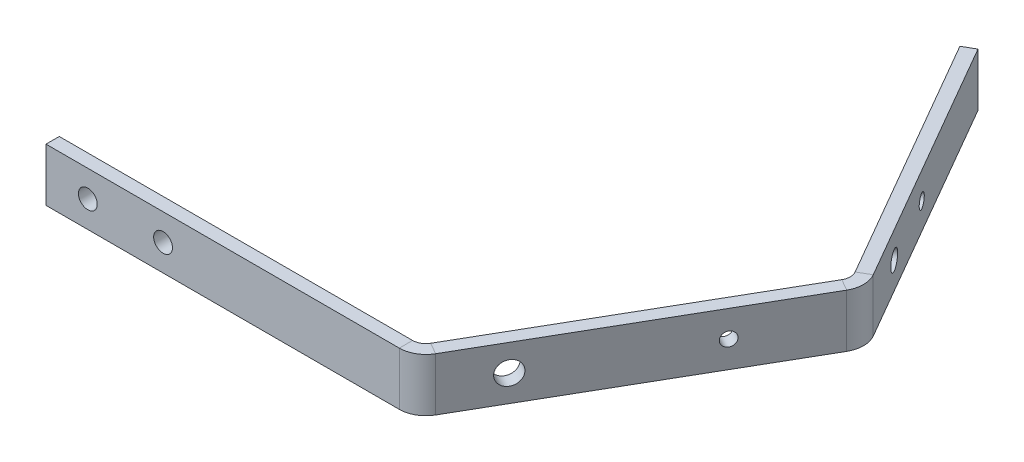
ISO-10303-21;
HEADER;
FILE_DESCRIPTION(('STEP AP214'),'2;1');
FILE_NAME('part.step','',(''),(''),'','','');
FILE_SCHEMA(('AUTOMOTIVE_DESIGN { 1 0 10303 214 1 1 1 1 }'));
ENDSEC;
DATA;
#1=APPLICATION_CONTEXT('core data for automotive mechanical design processes');
#2=APPLICATION_PROTOCOL_DEFINITION('international standard','automotive_design',2000,#1);
#3=PRODUCT_CONTEXT('',#1,'mechanical');
#4=PRODUCT('Part','Part','',(#3));
#5=PRODUCT_RELATED_PRODUCT_CATEGORY('part','',(#4));
#6=PRODUCT_DEFINITION_FORMATION('','',#4);
#7=PRODUCT_DEFINITION_CONTEXT('part definition',#1,'design');
#8=PRODUCT_DEFINITION('design','',#6,#7);
#9=PRODUCT_DEFINITION_SHAPE('','',#8);
#10=(LENGTH_UNIT() NAMED_UNIT(*) SI_UNIT(.MILLI.,.METRE.));
#11=(NAMED_UNIT(*) PLANE_ANGLE_UNIT() SI_UNIT($,.RADIAN.));
#12=(NAMED_UNIT(*) SI_UNIT($,.STERADIAN.) SOLID_ANGLE_UNIT());
#13=UNCERTAINTY_MEASURE_WITH_UNIT(LENGTH_MEASURE(1.E-05),#10,'distance_accuracy_value','');
#14=(GEOMETRIC_REPRESENTATION_CONTEXT(3) GLOBAL_UNCERTAINTY_ASSIGNED_CONTEXT((#13)) GLOBAL_UNIT_ASSIGNED_CONTEXT((#10,
#11,#12)) REPRESENTATION_CONTEXT('',''));
#15=CARTESIAN_POINT('',(0.,0.,0.));
#16=DIRECTION('',(0.,0.,1.));
#17=DIRECTION('',(1.,0.,0.));
#18=AXIS2_PLACEMENT_3D('',#15,#16,#17);
#19=CARTESIAN_POINT('',(-13.4757943029473,0.,-27.4034719360652));
#20=DIRECTION('',(-0.86602540378444,0.,-0.499999999999998));
#21=DIRECTION('',(-0.499999999999998,0.,0.86602540378444));
#22=AXIS2_PLACEMENT_3D('',#19,#20,#21);
#23=PLANE('',#22);
#24=CARTESIAN_POINT('',(-1.79699873723114,-7.51082345891387E-13,-47.6317392270958));
#25=DIRECTION('',(-0.86602540378444,0.,-0.499999999999998));
#26=DIRECTION('',(-0.499999999999998,0.,0.86602540378444));
#27=AXIS2_PLACEMENT_3D('',#24,#25,#26);
#28=CIRCLE('',#27,1.65000000164973);
#29=CARTESIAN_POINT('',(-2.621998738056,-7.51082345891387E-13,-46.2027973094228));
#30=VERTEX_POINT('',#29);
#31=EDGE_CURVE('E275',#30,#30,#28,.T.);
#32=ORIENTED_EDGE('',*,*,#31,.T.);
#33=EDGE_LOOP('',(#32));
#34=FACE_BOUND('',#33,.T.);
#35=CARTESIAN_POINT('',(-21.0087319455712,2.79637424327461E-12,-14.3560412087924));
#36=DIRECTION('',(0.86602540378444,0.,0.499999999999998));
#37=DIRECTION('',(0.499999999999998,0.,-0.86602540378444));
#38=AXIS2_PLACEMENT_3D('',#35,#36,#37);
#39=CIRCLE('',#38,2.75000000078553);
#40=CARTESIAN_POINT('',(-19.6337319451785,2.79637424327461E-12,-16.7376110698799));
#41=VERTEX_POINT('',#40);
#42=EDGE_CURVE('E259',#41,#41,#39,.T.);
#43=ORIENTED_EDGE('',*,*,#42,.F.);
#44=EDGE_LOOP('',(#43));
#45=FACE_BOUND('',#44,.T.);
#46=DIRECTION('',(0.499999999999998,0.,-0.86602540378444));
#47=VECTOR('',#46,1.);
#48=CARTESIAN_POINT('',(-72.225794302947,-6.35,74.3545130086064));
#49=LINE('',#48,#47);
#50=CARTESIAN_POINT('',(-27.4626657216148,-6.34999999999998,-3.17749999999999));
#51=VERTEX_POINT('',#50);
#52=CARTESIAN_POINT('',(8.5392056970526,-6.35,-65.5345704646941));
#53=VERTEX_POINT('',#52);
#54=EDGE_CURVE('E66',#51,#53,#49,.T.);
#55=ORIENTED_EDGE('',*,*,#54,.T.);
#56=DIRECTION('',(0.,1.,0.));
#57=VECTOR('',#56,1.);
#58=CARTESIAN_POINT('',(8.53920569705261,0.,-65.5345704646941));
#59=LINE('',#58,#57);
#60=CARTESIAN_POINT('',(8.5392056970526,6.35,-65.5345704646941));
#61=VERTEX_POINT('',#60);
#62=EDGE_CURVE('E58',#53,#61,#59,.T.);
#63=ORIENTED_EDGE('',*,*,#62,.T.);
#64=DIRECTION('',(-0.499999999999998,0.,0.86602540378444));
#65=VECTOR('',#64,1.);
#66=CARTESIAN_POINT('',(-72.225794302947,6.35,74.3545130086064));
#67=LINE('',#66,#65);
#68=CARTESIAN_POINT('',(-27.4626657216148,6.35,-3.17749999999999));
#69=VERTEX_POINT('',#68);
#70=EDGE_CURVE('E74',#61,#69,#67,.T.);
#71=ORIENTED_EDGE('',*,*,#70,.T.);
#72=DIRECTION('',(0.,1.,0.));
#73=VECTOR('',#72,1.);
#74=CARTESIAN_POINT('',(-27.4626657216148,0.,-3.17750000000003));
#75=LINE('',#74,#73);
#76=EDGE_CURVE('E236',#51,#69,#75,.T.);
#77=ORIENTED_EDGE('',*,*,#76,.F.);
#78=EDGE_LOOP('',(#55,#63,#71,#77));
#79=FACE_BOUND('',#78,.T.);
#80=ADVANCED_FACE('F49',(#34,#45,#79),#23,.F.);
#81=CARTESIAN_POINT('',(-74.9754249599627,-6.35,72.7670130086064));
#82=DIRECTION('',(0.,-1.,0.));
#83=DIRECTION('',(-0.86602540378444,0.,-0.499999999999998));
#84=AXIS2_PLACEMENT_3D('',#81,#82,#83);
#85=PLANE('',#84);
#86=DIRECTION('',(-0.86602540378444,0.,-0.499999999999998));
#87=VECTOR('',#86,1.);
#88=CARTESIAN_POINT('',(5.78957504003701,-6.35,-67.1220704646941));
#89=LINE('',#88,#87);
#90=CARTESIAN_POINT('',(5.789575040037,-6.35,-67.1220704646941));
#91=VERTEX_POINT('',#90);
#92=EDGE_CURVE('E12',#53,#91,#89,.T.);
#93=ORIENTED_EDGE('',*,*,#92,.F.);
#94=ORIENTED_EDGE('',*,*,#54,.F.);
#95=DIRECTION('',(-0.86602540378444,0.,-0.499999999999998));
#96=VECTOR('',#95,1.);
#97=CARTESIAN_POINT('',(-30.2122963786304,-6.35,-4.76500000000003));
#98=LINE('',#97,#96);
#99=CARTESIAN_POINT('',(-30.2122963786304,-6.34999999999999,-4.765));
#100=VERTEX_POINT('',#99);
#101=EDGE_CURVE('E232',#51,#100,#98,.T.);
#102=ORIENTED_EDGE('',*,*,#101,.T.);
#103=DIRECTION('',(0.499999999999998,0.,-0.86602540378444));
#104=VECTOR('',#103,1.);
#105=CARTESIAN_POINT('',(-74.9754249599627,-6.35,72.7670130086064));
#106=LINE('',#105,#104);
#107=EDGE_CURVE('E233',#100,#91,#106,.T.);
#108=ORIENTED_EDGE('',*,*,#107,.T.);
#109=EDGE_LOOP('',(#93,#94,#102,#108));
#110=FACE_BOUND('',#109,.T.);
#111=ADVANCED_FACE('F51',(#110),#85,.T.);
#112=CARTESIAN_POINT('',(-74.9754249599627,6.35,72.7670130086064));
#113=DIRECTION('',(0.,1.,0.));
#114=DIRECTION('',(0.86602540378444,0.,0.499999999999998));
#115=AXIS2_PLACEMENT_3D('',#112,#113,#114);
#116=PLANE('',#115);
#117=DIRECTION('',(0.86602540378444,0.,0.499999999999998));
#118=VECTOR('',#117,1.);
#119=CARTESIAN_POINT('',(5.78957504003701,6.35,-67.1220704646941));
#120=LINE('',#119,#118);
#121=CARTESIAN_POINT('',(5.78957504003699,6.35,-67.1220704646941));
#122=VERTEX_POINT('',#121);
#123=EDGE_CURVE('E244',#122,#61,#120,.T.);
#124=ORIENTED_EDGE('',*,*,#123,.F.);
#125=DIRECTION('',(-0.499999999999998,0.,0.86602540378444));
#126=VECTOR('',#125,1.);
#127=CARTESIAN_POINT('',(-74.9754249599627,6.35,72.7670130086064));
#128=LINE('',#127,#126);
#129=CARTESIAN_POINT('',(-30.2122963786304,6.35,-4.76500000000001));
#130=VERTEX_POINT('',#129);
#131=EDGE_CURVE('E249',#122,#130,#128,.T.);
#132=ORIENTED_EDGE('',*,*,#131,.T.);
#133=DIRECTION('',(0.86602540378444,0.,0.499999999999998));
#134=VECTOR('',#133,1.);
#135=CARTESIAN_POINT('',(-30.2122963786304,6.35,-4.76500000000003));
#136=LINE('',#135,#134);
#137=EDGE_CURVE('E239',#130,#69,#136,.T.);
#138=ORIENTED_EDGE('',*,*,#137,.T.);
#139=ORIENTED_EDGE('',*,*,#70,.F.);
#140=EDGE_LOOP('',(#124,#132,#138,#139));
#141=FACE_BOUND('',#140,.T.);
#142=ADVANCED_FACE('F317',(#141),#116,.T.);
#143=CARTESIAN_POINT('',(-16.2254249599629,0.,-28.9909719360652));
#144=DIRECTION('',(-0.86602540378444,0.,-0.499999999999998));
#145=DIRECTION('',(-0.499999999999998,0.,0.86602540378444));
#146=AXIS2_PLACEMENT_3D('',#143,#144,#145);
#147=PLANE('',#146);
#148=CARTESIAN_POINT('',(-4.54662939424674,-7.51082345891387E-13,-49.2192392270958));
#149=DIRECTION('',(-0.86602540378444,0.,-0.499999999999998));
#150=DIRECTION('',(-0.499999999999998,0.,0.86602540378444));
#151=AXIS2_PLACEMENT_3D('',#148,#149,#150);
#152=CIRCLE('',#151,1.65000000164973);
#153=CARTESIAN_POINT('',(-5.3716293950716,-7.51082345891387E-13,-47.7902973094228));
#154=VERTEX_POINT('',#153);
#155=EDGE_CURVE('E651',#154,#154,#152,.T.);
#156=ORIENTED_EDGE('',*,*,#155,.F.);
#157=EDGE_LOOP('',(#156));
#158=FACE_BOUND('',#157,.T.);
#159=CARTESIAN_POINT('',(-23.7583626025868,2.79637424327461E-12,-15.9435412087924));
#160=DIRECTION('',(-0.86602540378444,0.,-0.499999999999998));
#161=DIRECTION('',(-0.499999999999998,0.,0.86602540378444));
#162=AXIS2_PLACEMENT_3D('',#159,#160,#161);
#163=CIRCLE('',#162,2.75000000078553);
#164=CARTESIAN_POINT('',(-25.1333626029796,2.79637424327461E-12,-13.5619713477049));
#165=VERTEX_POINT('',#164);
#166=EDGE_CURVE('E256',#165,#165,#163,.T.);
#167=ORIENTED_EDGE('',*,*,#166,.F.);
#168=EDGE_LOOP('',(#167));
#169=FACE_BOUND('',#168,.T.);
#170=DIRECTION('',(0.,1.,0.));
#171=VECTOR('',#170,1.);
#172=CARTESIAN_POINT('',(5.78957504003702,0.,-67.1220704646941));
#173=LINE('',#172,#171);
#174=EDGE_CURVE('E241',#91,#122,#173,.T.);
#175=ORIENTED_EDGE('',*,*,#174,.F.);
#176=ORIENTED_EDGE('',*,*,#107,.F.);
#177=DIRECTION('',(0.,1.,0.));
#178=VECTOR('',#177,1.);
#179=CARTESIAN_POINT('',(-30.2122963786304,0.,-4.76500000000003));
#180=LINE('',#179,#178);
#181=EDGE_CURVE('E229',#100,#130,#180,.T.);
#182=ORIENTED_EDGE('',*,*,#181,.T.);
#183=ORIENTED_EDGE('',*,*,#131,.F.);
#184=EDGE_LOOP('',(#175,#176,#182,#183));
#185=FACE_BOUND('',#184,.T.);
#186=ADVANCED_FACE('F309',(#158,#169,#185),#147,.T.);
#187=CARTESIAN_POINT('',(-117.5,-6.35,-3.175));
#188=DIRECTION('',(-1.,0.,0.));
#189=DIRECTION('',(0.,0.,1.));
#190=AXIS2_PLACEMENT_3D('',#187,#188,#189);
#191=PLANE('',#190);
#192=DIRECTION('',(0.,-1.,0.));
#193=VECTOR('',#192,1.);
#194=CARTESIAN_POINT('',(-117.5,-6.35,0.));
#195=LINE('',#194,#193);
#196=CARTESIAN_POINT('',(-117.5,6.35,0.));
#197=VERTEX_POINT('',#196);
#198=CARTESIAN_POINT('',(-117.5,-6.35,0.));
#199=VERTEX_POINT('',#198);
#200=EDGE_CURVE('E204',#197,#199,#195,.T.);
#201=ORIENTED_EDGE('',*,*,#200,.F.);
#202=DIRECTION('',(0.,0.,1.));
#203=VECTOR('',#202,1.);
#204=CARTESIAN_POINT('',(-117.5,6.35,-3.175));
#205=LINE('',#204,#203);
#206=CARTESIAN_POINT('',(-117.5,6.35,-3.175));
#207=VERTEX_POINT('',#206);
#208=EDGE_CURVE('E199',#207,#197,#205,.T.);
#209=ORIENTED_EDGE('',*,*,#208,.F.);
#210=DIRECTION('',(0.,-1.,0.));
#211=VECTOR('',#210,1.);
#212=CARTESIAN_POINT('',(-117.5,-6.35,-3.175));
#213=LINE('',#212,#211);
#214=CARTESIAN_POINT('',(-117.5,-6.35,-3.175));
#215=VERTEX_POINT('',#214);
#216=EDGE_CURVE('E218',#207,#215,#213,.T.);
#217=ORIENTED_EDGE('',*,*,#216,.T.);
#218=DIRECTION('',(0.,0.,1.));
#219=VECTOR('',#218,1.);
#220=CARTESIAN_POINT('',(-117.5,-6.35,-3.175));
#221=LINE('',#220,#219);
#222=EDGE_CURVE('E216',#215,#199,#221,.T.);
#223=ORIENTED_EDGE('',*,*,#222,.T.);
#224=EDGE_LOOP('',(#201,#209,#217,#223));
#225=FACE_BOUND('',#224,.T.);
#226=ADVANCED_FACE('F349',(#225),#191,.T.);
#227=CARTESIAN_POINT('',(0.,0.,-3.175));
#228=DIRECTION('',(0.,0.,-1.));
#229=DIRECTION('',(-1.,0.,0.));
#230=AXIS2_PLACEMENT_3D('',#227,#228,#229);
#231=PLANE('',#230);
#232=CARTESIAN_POINT('',(-107.489373825115,-2.83280343627013E-12,-3.175));
#233=DIRECTION('',(0.,0.,-1.));
#234=DIRECTION('',(-1.,0.,0.));
#235=AXIS2_PLACEMENT_3D('',#232,#233,#234);
#236=CIRCLE('',#235,2.2500000000082);
#237=CARTESIAN_POINT('',(-109.739373825123,-2.83280343627013E-12,-3.175));
#238=VERTEX_POINT('',#237);
#239=EDGE_CURVE('E262',#238,#238,#236,.T.);
#240=ORIENTED_EDGE('',*,*,#239,.F.);
#241=EDGE_LOOP('',(#240));
#242=FACE_BOUND('',#241,.T.);
#243=CARTESIAN_POINT('',(-89.4893738254488,-2.82933398931817E-12,-3.175));
#244=DIRECTION('',(0.,0.,-1.));
#245=DIRECTION('',(-1.,0.,0.));
#246=AXIS2_PLACEMENT_3D('',#243,#244,#245);
#247=CIRCLE('',#246,2.25000000054032);
#248=CARTESIAN_POINT('',(-91.7393738259891,-2.82933398931817E-12,-3.175));
#249=VERTEX_POINT('',#248);
#250=EDGE_CURVE('E255',#249,#249,#247,.T.);
#251=ORIENTED_EDGE('',*,*,#250,.F.);
#252=EDGE_LOOP('',(#251));
#253=FACE_BOUND('',#252,.T.);
#254=DIRECTION('',(0.,1.,0.));
#255=VECTOR('',#254,1.);
#256=CARTESIAN_POINT('',(-32.9662571626649,0.,-3.175));
#257=LINE('',#256,#255);
#258=CARTESIAN_POINT('',(-32.9662571626649,-6.34999999999999,-3.175));
#259=VERTEX_POINT('',#258);
#260=CARTESIAN_POINT('',(-32.9662571626649,6.35,-3.175));
#261=VERTEX_POINT('',#260);
#262=EDGE_CURVE('E194',#259,#261,#257,.T.);
#263=ORIENTED_EDGE('',*,*,#262,.F.);
#264=DIRECTION('',(1.,0.,0.));
#265=VECTOR('',#264,1.);
#266=CARTESIAN_POINT('',(-117.5,-6.35,-3.175));
#267=LINE('',#266,#265);
#268=EDGE_CURVE('E214',#215,#259,#267,.T.);
#269=ORIENTED_EDGE('',*,*,#268,.F.);
#270=ORIENTED_EDGE('',*,*,#216,.F.);
#271=DIRECTION('',(-1.,0.,0.));
#272=VECTOR('',#271,1.);
#273=CARTESIAN_POINT('',(-117.5,6.35,-3.175));
#274=LINE('',#273,#272);
#275=EDGE_CURVE('E202',#261,#207,#274,.T.);
#276=ORIENTED_EDGE('',*,*,#275,.F.);
#277=EDGE_LOOP('',(#263,#269,#270,#276));
#278=FACE_BOUND('',#277,.T.);
#279=ADVANCED_FACE('F341',(#242,#253,#278),#231,.T.);
#280=CARTESIAN_POINT('',(-117.5,-6.35,-3.175));
#281=DIRECTION('',(0.,-1.,0.));
#282=DIRECTION('',(0.,0.,-1.));
#283=AXIS2_PLACEMENT_3D('',#280,#281,#282);
#284=PLANE('',#283);
#285=DIRECTION('',(0.,0.,-1.));
#286=VECTOR('',#285,1.);
#287=CARTESIAN_POINT('',(-32.9662571626649,-6.35,-3.175));
#288=LINE('',#287,#286);
#289=CARTESIAN_POINT('',(-32.9662571626649,-6.35,0.));
#290=VERTEX_POINT('',#289);
#291=EDGE_CURVE('E221',#290,#259,#288,.T.);
#292=ORIENTED_EDGE('',*,*,#291,.F.);
#293=DIRECTION('',(1.,0.,0.));
#294=VECTOR('',#293,1.);
#295=CARTESIAN_POINT('',(-117.5,-6.35,0.));
#296=LINE('',#295,#294);
#297=EDGE_CURVE('E212',#199,#290,#296,.T.);
#298=ORIENTED_EDGE('',*,*,#297,.F.);
#299=ORIENTED_EDGE('',*,*,#222,.F.);
#300=ORIENTED_EDGE('',*,*,#268,.T.);
#301=EDGE_LOOP('',(#292,#298,#299,#300));
#302=FACE_BOUND('',#301,.T.);
#303=ADVANCED_FACE('F337',(#302),#284,.T.);
#304=CARTESIAN_POINT('',(0.,0.,0.));
#305=DIRECTION('',(0.,0.,-1.));
#306=DIRECTION('',(-1.,0.,0.));
#307=AXIS2_PLACEMENT_3D('',#304,#305,#306);
#308=PLANE('',#307);
#309=CARTESIAN_POINT('',(-107.489373825115,-2.83280343627013E-12,0.));
#310=DIRECTION('',(0.,0.,-1.));
#311=DIRECTION('',(-1.,0.,0.));
#312=AXIS2_PLACEMENT_3D('',#309,#310,#311);
#313=CIRCLE('',#312,2.2500000000082);
#314=CARTESIAN_POINT('',(-109.739373825123,-2.83280343627013E-12,0.));
#315=VERTEX_POINT('',#314);
#316=EDGE_CURVE('E260',#315,#315,#313,.T.);
#317=ORIENTED_EDGE('',*,*,#316,.T.);
#318=EDGE_LOOP('',(#317));
#319=FACE_BOUND('',#318,.T.);
#320=CARTESIAN_POINT('',(-89.4893738254488,-2.82933398931817E-12,0.));
#321=DIRECTION('',(0.,0.,-1.));
#322=DIRECTION('',(-1.,0.,0.));
#323=AXIS2_PLACEMENT_3D('',#320,#321,#322);
#324=CIRCLE('',#323,2.25000000054032);
#325=CARTESIAN_POINT('',(-91.7393738259891,-2.82933398931817E-12,0.));
#326=VERTEX_POINT('',#325);
#327=EDGE_CURVE('E171',#326,#326,#324,.T.);
#328=ORIENTED_EDGE('',*,*,#327,.T.);
#329=EDGE_LOOP('',(#328));
#330=FACE_BOUND('',#329,.T.);
#331=ORIENTED_EDGE('',*,*,#297,.T.);
#332=DIRECTION('',(0.,1.,0.));
#333=VECTOR('',#332,1.);
#334=CARTESIAN_POINT('',(-32.9662571626649,0.,0.));
#335=LINE('',#334,#333);
#336=CARTESIAN_POINT('',(-32.9662571626649,6.35,0.));
#337=VERTEX_POINT('',#336);
#338=EDGE_CURVE('E209',#290,#337,#335,.T.);
#339=ORIENTED_EDGE('',*,*,#338,.T.);
#340=DIRECTION('',(-1.,0.,0.));
#341=VECTOR('',#340,1.);
#342=CARTESIAN_POINT('',(-117.5,6.35,0.));
#343=LINE('',#342,#341);
#344=EDGE_CURVE('E207',#337,#197,#343,.T.);
#345=ORIENTED_EDGE('',*,*,#344,.T.);
#346=ORIENTED_EDGE('',*,*,#200,.T.);
#347=EDGE_LOOP('',(#331,#339,#345,#346));
#348=FACE_BOUND('',#347,.T.);
#349=ADVANCED_FACE('F347',(#319,#330,#348),#308,.F.);
#350=CARTESIAN_POINT('',(-117.5,6.35,-3.175));
#351=DIRECTION('',(0.,1.,0.));
#352=DIRECTION('',(0.,0.,1.));
#353=AXIS2_PLACEMENT_3D('',#350,#351,#352);
#354=PLANE('',#353);
#355=DIRECTION('',(0.,0.,1.));
#356=VECTOR('',#355,1.);
#357=CARTESIAN_POINT('',(-32.9662571626649,6.35,-3.175));
#358=LINE('',#357,#356);
#359=EDGE_CURVE('E224',#261,#337,#358,.T.);
#360=ORIENTED_EDGE('',*,*,#359,.F.);
#361=ORIENTED_EDGE('',*,*,#275,.T.);
#362=ORIENTED_EDGE('',*,*,#208,.T.);
#363=ORIENTED_EDGE('',*,*,#344,.F.);
#364=EDGE_LOOP('',(#360,#361,#362,#363));
#365=FACE_BOUND('',#364,.T.);
#366=ADVANCED_FACE('F344',(#365),#354,.T.);
#367=CARTESIAN_POINT('',(-32.9662571626649,-6.34999999999999,-6.355));
#368=DIRECTION('',(0.,1.,0.));
#369=DIRECTION('',(0.,0.,1.));
#370=AXIS2_PLACEMENT_3D('',#367,#368,#369);
#371=PLANE('',#370);
#372=ORIENTED_EDGE('',*,*,#101,.F.);
#373=CARTESIAN_POINT('',(-32.9662571626649,-6.34999999999999,-6.355));
#374=DIRECTION('',(0.,-1.,0.));
#375=DIRECTION('',(0.,0.,-1.));
#376=AXIS2_PLACEMENT_3D('',#373,#374,#375);
#377=CIRCLE('',#376,6.355);
#378=EDGE_CURVE('E182',#51,#290,#377,.T.);
#379=ORIENTED_EDGE('',*,*,#378,.T.);
#380=ORIENTED_EDGE('',*,*,#291,.T.);
#381=CARTESIAN_POINT('',(-32.9662571626649,-6.34999999999999,-6.355));
#382=DIRECTION('',(0.,-1.,0.));
#383=DIRECTION('',(0.,0.,1.));
#384=AXIS2_PLACEMENT_3D('',#381,#382,#383);
#385=CIRCLE('',#384,3.18);
#386=EDGE_CURVE('E187',#100,#259,#385,.T.);
#387=ORIENTED_EDGE('',*,*,#386,.F.);
#388=EDGE_LOOP('',(#372,#379,#380,#387));
#389=FACE_BOUND('',#388,.T.);
#390=ADVANCED_FACE('F333',(#389),#371,.F.);
#391=CARTESIAN_POINT('',(-32.9662571626649,6.35,-6.355));
#392=DIRECTION('',(0.,-1.,0.));
#393=DIRECTION('',(0.,0.,-1.));
#394=AXIS2_PLACEMENT_3D('',#391,#392,#393);
#395=PLANE('',#394);
#396=CARTESIAN_POINT('',(-32.9662571626649,6.35,-6.355));
#397=DIRECTION('',(0.,-1.,0.));
#398=DIRECTION('',(0.,0.,-1.));
#399=AXIS2_PLACEMENT_3D('',#396,#397,#398);
#400=CIRCLE('',#399,6.355);
#401=EDGE_CURVE('E191',#337,#69,#400,.F.);
#402=ORIENTED_EDGE('',*,*,#401,.T.);
#403=ORIENTED_EDGE('',*,*,#137,.F.);
#404=CARTESIAN_POINT('',(-32.9662571626649,6.35,-6.355));
#405=DIRECTION('',(0.,1.,0.));
#406=DIRECTION('',(0.,0.,-1.));
#407=AXIS2_PLACEMENT_3D('',#404,#405,#406);
#408=CIRCLE('',#407,3.18);
#409=EDGE_CURVE('E190',#261,#130,#408,.T.);
#410=ORIENTED_EDGE('',*,*,#409,.F.);
#411=ORIENTED_EDGE('',*,*,#359,.T.);
#412=EDGE_LOOP('',(#402,#403,#410,#411));
#413=FACE_BOUND('',#412,.T.);
#414=ADVANCED_FACE('F325',(#413),#395,.F.);
#415=CARTESIAN_POINT('',(-32.9662571626649,14.0105611696542,-6.355));
#416=DIRECTION('',(0.,-1.,0.));
#417=DIRECTION('',(0.,0.,-1.));
#418=AXIS2_PLACEMENT_3D('',#415,#416,#417);
#419=CYLINDRICAL_SURFACE('',#418,3.18);
#420=ORIENTED_EDGE('',*,*,#262,.T.);
#421=ORIENTED_EDGE('',*,*,#409,.T.);
#422=ORIENTED_EDGE('',*,*,#181,.F.);
#423=ORIENTED_EDGE('',*,*,#386,.T.);
#424=EDGE_LOOP('',(#420,#421,#422,#423));
#425=FACE_BOUND('',#424,.T.);
#426=ADVANCED_FACE('F321',(#425),#419,.F.);
#427=CARTESIAN_POINT('',(-32.9662571626649,14.0105611696542,-6.355));
#428=DIRECTION('',(0.,-1.,0.));
#429=DIRECTION('',(0.,0.,-1.));
#430=AXIS2_PLACEMENT_3D('',#427,#428,#429);
#431=CYLINDRICAL_SURFACE('',#430,6.355);
#432=ORIENTED_EDGE('',*,*,#338,.F.);
#433=ORIENTED_EDGE('',*,*,#378,.F.);
#434=ORIENTED_EDGE('',*,*,#76,.T.);
#435=ORIENTED_EDGE('',*,*,#401,.F.);
#436=EDGE_LOOP('',(#432,#433,#434,#435));
#437=FACE_BOUND('',#436,.T.);
#438=ADVANCED_FACE('F330',(#437),#431,.T.);
#439=CARTESIAN_POINT('',(3.0356142560025,-6.35,-68.7120704646941));
#440=DIRECTION('',(0.,1.,0.));
#441=DIRECTION('',(0.,0.,1.));
#442=AXIS2_PLACEMENT_3D('',#439,#440,#441);
#443=PLANE('',#442);
#444=DIRECTION('',(-0.866025403784436,0.,0.500000000000004));
#445=VECTOR('',#444,1.);
#446=CARTESIAN_POINT('',(5.78957504003701,-6.35,-70.3020704646942));
#447=LINE('',#446,#445);
#448=CARTESIAN_POINT('',(8.53920569705265,-6.35,-71.8895704646941));
#449=VERTEX_POINT('',#448);
#450=CARTESIAN_POINT('',(5.78957504003699,-6.35,-70.3020704646941));
#451=VERTEX_POINT('',#450);
#452=EDGE_CURVE('E148',#449,#451,#447,.T.);
#453=ORIENTED_EDGE('',*,*,#452,.F.);
#454=CARTESIAN_POINT('',(3.0356142560025,-6.35,-68.7120704646941));
#455=DIRECTION('',(0.,-1.,0.));
#456=DIRECTION('',(0.,0.,-1.));
#457=AXIS2_PLACEMENT_3D('',#454,#455,#456);
#458=CIRCLE('',#457,6.355);
#459=EDGE_CURVE('E159',#449,#53,#458,.T.);
#460=ORIENTED_EDGE('',*,*,#459,.T.);
#461=ORIENTED_EDGE('',*,*,#92,.T.);
#462=CARTESIAN_POINT('',(3.0356142560025,-6.35,-68.7120704646941));
#463=DIRECTION('',(0.,-1.,0.));
#464=DIRECTION('',(0.,0.,1.));
#465=AXIS2_PLACEMENT_3D('',#462,#463,#464);
#466=CIRCLE('',#465,3.18);
#467=EDGE_CURVE('E175',#451,#91,#466,.T.);
#468=ORIENTED_EDGE('',*,*,#467,.F.);
#469=EDGE_LOOP('',(#453,#460,#461,#468));
#470=FACE_BOUND('',#469,.T.);
#471=ADVANCED_FACE('F311',(#470),#443,.F.);
#472=CARTESIAN_POINT('',(3.0356142560025,6.35,-68.7120704646941));
#473=DIRECTION('',(0.,-1.,0.));
#474=DIRECTION('',(0.,0.,-1.));
#475=AXIS2_PLACEMENT_3D('',#472,#473,#474);
#476=PLANE('',#475);
#477=CARTESIAN_POINT('',(3.0356142560025,6.35,-68.7120704646941));
#478=DIRECTION('',(0.,-1.,0.));
#479=DIRECTION('',(0.,0.,-1.));
#480=AXIS2_PLACEMENT_3D('',#477,#478,#479);
#481=CIRCLE('',#480,6.355);
#482=CARTESIAN_POINT('',(8.53920569705265,6.35,-71.8895704646941));
#483=VERTEX_POINT('',#482);
#484=EDGE_CURVE('E179',#61,#483,#481,.F.);
#485=ORIENTED_EDGE('',*,*,#484,.T.);
#486=DIRECTION('',(0.866025403784436,0.,-0.500000000000004));
#487=VECTOR('',#486,1.);
#488=CARTESIAN_POINT('',(5.78957504003701,6.35,-70.3020704646942));
#489=LINE('',#488,#487);
#490=CARTESIAN_POINT('',(5.78957504003701,6.35,-70.3020704646942));
#491=VERTEX_POINT('',#490);
#492=EDGE_CURVE('E292',#491,#483,#489,.T.);
#493=ORIENTED_EDGE('',*,*,#492,.F.);
#494=CARTESIAN_POINT('',(3.0356142560025,6.35,-68.7120704646941));
#495=DIRECTION('',(0.,1.,0.));
#496=DIRECTION('',(0.,0.,-1.));
#497=AXIS2_PLACEMENT_3D('',#494,#495,#496);
#498=CIRCLE('',#497,3.18);
#499=EDGE_CURVE('E178',#122,#491,#498,.T.);
#500=ORIENTED_EDGE('',*,*,#499,.F.);
#501=ORIENTED_EDGE('',*,*,#123,.T.);
#502=EDGE_LOOP('',(#485,#493,#500,#501));
#503=FACE_BOUND('',#502,.T.);
#504=ADVANCED_FACE('F303',(#503),#476,.F.);
#505=CARTESIAN_POINT('',(3.0356142560025,14.9583075639477,-68.7120704646941));
#506=DIRECTION('',(0.,-1.,0.));
#507=DIRECTION('',(0.,0.,-1.));
#508=AXIS2_PLACEMENT_3D('',#505,#506,#507);
#509=CYLINDRICAL_SURFACE('',#508,3.18);
#510=ORIENTED_EDGE('',*,*,#174,.T.);
#511=ORIENTED_EDGE('',*,*,#499,.T.);
#512=DIRECTION('',(0.,1.,0.));
#513=VECTOR('',#512,1.);
#514=CARTESIAN_POINT('',(5.78957504003703,0.,-70.3020704646941));
#515=LINE('',#514,#513);
#516=EDGE_CURVE('E168',#451,#491,#515,.T.);
#517=ORIENTED_EDGE('',*,*,#516,.F.);
#518=ORIENTED_EDGE('',*,*,#467,.T.);
#519=EDGE_LOOP('',(#510,#511,#517,#518));
#520=FACE_BOUND('',#519,.T.);
#521=ADVANCED_FACE('F305',(#520),#509,.F.);
#522=CARTESIAN_POINT('',(3.0356142560025,14.9583075639477,-68.7120704646941));
#523=DIRECTION('',(0.,-1.,0.));
#524=DIRECTION('',(0.,0.,-1.));
#525=AXIS2_PLACEMENT_3D('',#522,#523,#524);
#526=CYLINDRICAL_SURFACE('',#525,6.355);
#527=ORIENTED_EDGE('',*,*,#62,.F.);
#528=ORIENTED_EDGE('',*,*,#459,.F.);
#529=DIRECTION('',(0.,1.,0.));
#530=VECTOR('',#529,1.);
#531=CARTESIAN_POINT('',(8.53920569705262,0.,-71.8895704646942));
#532=LINE('',#531,#530);
#533=EDGE_CURVE('E166',#449,#483,#532,.T.);
#534=ORIENTED_EDGE('',*,*,#533,.T.);
#535=ORIENTED_EDGE('',*,*,#484,.F.);
#536=EDGE_LOOP('',(#527,#528,#534,#535));
#537=FACE_BOUND('',#536,.T.);
#538=ADVANCED_FACE('F316',(#537),#526,.T.);
#539=CARTESIAN_POINT('',(-28.4491677972984,-6.35,-129.605312646243));
#540=DIRECTION('',(-0.500000000000004,0.,-0.866025403784436));
#541=DIRECTION('',(-0.866025403784436,0.,0.500000000000004));
#542=AXIS2_PLACEMENT_3D('',#539,#540,#541);
#543=PLANE('',#542);
#544=DIRECTION('',(0.,1.,0.));
#545=VECTOR('',#544,1.);
#546=CARTESIAN_POINT('',(-25.6995371402828,-6.35,-131.192812646243));
#547=LINE('',#546,#545);
#548=CARTESIAN_POINT('',(-25.6995371402828,-6.35,-131.192812646243));
#549=VERTEX_POINT('',#548);
#550=CARTESIAN_POINT('',(-25.6995371402828,6.35,-131.192812646243));
#551=VERTEX_POINT('',#550);
#552=EDGE_CURVE('E158',#549,#551,#547,.T.);
#553=ORIENTED_EDGE('',*,*,#552,.F.);
#554=DIRECTION('',(0.866025403784436,0.,-0.500000000000004));
#555=VECTOR('',#554,1.);
#556=CARTESIAN_POINT('',(-28.4491677972984,-6.35,-129.605312646243));
#557=LINE('',#556,#555);
#558=CARTESIAN_POINT('',(-28.4491677972984,-6.35,-129.605312646243));
#559=VERTEX_POINT('',#558);
#560=EDGE_CURVE('E145',#559,#549,#557,.T.);
#561=ORIENTED_EDGE('',*,*,#560,.F.);
#562=DIRECTION('',(0.,1.,0.));
#563=VECTOR('',#562,1.);
#564=CARTESIAN_POINT('',(-28.4491677972984,-6.35,-129.605312646243));
#565=LINE('',#564,#563);
#566=CARTESIAN_POINT('',(-28.4491677972984,6.35,-129.605312646243));
#567=VERTEX_POINT('',#566);
#568=EDGE_CURVE('E156',#559,#567,#565,.T.);
#569=ORIENTED_EDGE('',*,*,#568,.T.);
#570=DIRECTION('',(0.866025403784436,0.,-0.500000000000004));
#571=VECTOR('',#570,1.);
#572=CARTESIAN_POINT('',(-28.4491677972984,6.35,-129.605312646243));
#573=LINE('',#572,#571);
#574=EDGE_CURVE('E165',#567,#551,#573,.T.);
#575=ORIENTED_EDGE('',*,*,#574,.T.);
#576=EDGE_LOOP('',(#553,#561,#569,#575));
#577=FACE_BOUND('',#576,.T.);
#578=ADVANCED_FACE('F155',(#577),#543,.T.);
#579=CARTESIAN_POINT('',(30.3008322027021,0.,-27.8473277015721));
#580=DIRECTION('',(-0.866025403784436,0.,0.500000000000004));
#581=DIRECTION('',(0.500000000000004,0.,0.866025403784436));
#582=AXIS2_PLACEMENT_3D('',#579,#580,#581);
#583=PLANE('',#582);
#584=CARTESIAN_POINT('',(-1.06235650077763,-2.80636682841028E-12,-82.1699640233688));
#585=DIRECTION('',(-0.866025403784436,0.,0.500000000000004));
#586=DIRECTION('',(0.500000000000004,0.,0.866025403784436));
#587=AXIS2_PLACEMENT_3D('',#584,#585,#586);
#588=CIRCLE('',#587,2.24999999998628);
#589=CARTESIAN_POINT('',(0.062643499215516,-2.80636682841028E-12,-80.2214068648657));
#590=VERTEX_POINT('',#589);
#591=EDGE_CURVE('E265',#590,#590,#588,.T.);
#592=ORIENTED_EDGE('',*,*,#591,.F.);
#593=EDGE_LOOP('',(#592));
#594=FACE_BOUND('',#593,.T.);
#595=CARTESIAN_POINT('',(-10.0623565006109,-2.8073244138666E-12,-97.7584212911996));
#596=DIRECTION('',(-0.866025403784436,0.,0.500000000000004));
#597=DIRECTION('',(0.500000000000004,0.,0.866025403784436));
#598=AXIS2_PLACEMENT_3D('',#595,#596,#597);
#599=CIRCLE('',#598,1.64999999998422);
#600=CARTESIAN_POINT('',(-9.23735650061874,-2.8073244138666E-12,-96.329479374969));
#601=VERTEX_POINT('',#600);
#602=EDGE_CURVE('E270',#601,#601,#599,.T.);
#603=ORIENTED_EDGE('',*,*,#602,.F.);
#604=EDGE_LOOP('',(#603));
#605=FACE_BOUND('',#604,.T.);
#606=DIRECTION('',(-0.500000000000004,0.,-0.866025403784436));
#607=VECTOR('',#606,1.);
#608=CARTESIAN_POINT('',(89.0508322027026,-6.35,73.9106572430991));
#609=LINE('',#608,#607);
#610=EDGE_CURVE('E142',#451,#559,#609,.T.);
#611=ORIENTED_EDGE('',*,*,#610,.F.);
#612=ORIENTED_EDGE('',*,*,#516,.T.);
#613=DIRECTION('',(0.500000000000004,0.,0.866025403784436));
#614=VECTOR('',#613,1.);
#615=CARTESIAN_POINT('',(89.0508322027026,6.35,73.9106572430991));
#616=LINE('',#615,#614);
#617=EDGE_CURVE('E164',#567,#491,#616,.T.);
#618=ORIENTED_EDGE('',*,*,#617,.F.);
#619=ORIENTED_EDGE('',*,*,#568,.F.);
#620=EDGE_LOOP('',(#611,#612,#618,#619));
#621=FACE_BOUND('',#620,.T.);
#622=ADVANCED_FACE('F162',(#594,#605,#621),#583,.T.);
#623=CARTESIAN_POINT('',(89.0508322027026,6.35,73.9106572430991));
#624=DIRECTION('',(0.,1.,0.));
#625=DIRECTION('',(0.866025403784436,0.,-0.500000000000004));
#626=AXIS2_PLACEMENT_3D('',#623,#624,#625);
#627=PLANE('',#626);
#628=ORIENTED_EDGE('',*,*,#617,.T.);
#629=ORIENTED_EDGE('',*,*,#492,.T.);
#630=DIRECTION('',(0.500000000000004,0.,0.866025403784436));
#631=VECTOR('',#630,1.);
#632=CARTESIAN_POINT('',(91.8004628597182,6.35,72.3231572430991));
#633=LINE('',#632,#631);
#634=EDGE_CURVE('E287',#551,#483,#633,.T.);
#635=ORIENTED_EDGE('',*,*,#634,.F.);
#636=ORIENTED_EDGE('',*,*,#574,.F.);
#637=EDGE_LOOP('',(#628,#629,#635,#636));
#638=FACE_BOUND('',#637,.T.);
#639=ADVANCED_FACE('F299',(#638),#627,.T.);
#640=CARTESIAN_POINT('',(33.0504628597177,0.,-29.4348277015721));
#641=DIRECTION('',(-0.866025403784436,0.,0.500000000000004));
#642=DIRECTION('',(0.500000000000004,0.,0.866025403784436));
#643=AXIS2_PLACEMENT_3D('',#640,#641,#642);
#644=PLANE('',#643);
#645=CARTESIAN_POINT('',(1.68727415623793,-2.80636682841028E-12,-83.7574640233688));
#646=DIRECTION('',(-0.866025403784436,0.,0.500000000000004));
#647=DIRECTION('',(0.500000000000004,0.,0.866025403784436));
#648=AXIS2_PLACEMENT_3D('',#645,#646,#647);
#649=CIRCLE('',#648,2.24999999998628);
#650=CARTESIAN_POINT('',(2.81227415623108,-2.80636682841028E-12,-81.8089068648657));
#651=VERTEX_POINT('',#650);
#652=EDGE_CURVE('E53',#651,#651,#649,.T.);
#653=ORIENTED_EDGE('',*,*,#652,.T.);
#654=EDGE_LOOP('',(#653));
#655=FACE_BOUND('',#654,.T.);
#656=CARTESIAN_POINT('',(-7.31272584359528,-2.8073244138666E-12,-99.3459212911996));
#657=DIRECTION('',(-0.866025403784436,0.,0.500000000000004));
#658=DIRECTION('',(0.500000000000004,0.,0.866025403784436));
#659=AXIS2_PLACEMENT_3D('',#656,#657,#658);
#660=CIRCLE('',#659,1.64999999998422);
#661=CARTESIAN_POINT('',(-6.48772584360316,-2.8073244138666E-12,-97.916979374969));
#662=VERTEX_POINT('',#661);
#663=EDGE_CURVE('E263',#662,#662,#660,.T.);
#664=ORIENTED_EDGE('',*,*,#663,.T.);
#665=EDGE_LOOP('',(#664));
#666=FACE_BOUND('',#665,.T.);
#667=ORIENTED_EDGE('',*,*,#533,.F.);
#668=DIRECTION('',(-0.500000000000004,0.,-0.866025403784436));
#669=VECTOR('',#668,1.);
#670=CARTESIAN_POINT('',(91.8004628597182,-6.35,72.3231572430991));
#671=LINE('',#670,#669);
#672=EDGE_CURVE('E290',#449,#549,#671,.T.);
#673=ORIENTED_EDGE('',*,*,#672,.T.);
#674=ORIENTED_EDGE('',*,*,#552,.T.);
#675=ORIENTED_EDGE('',*,*,#634,.T.);
#676=EDGE_LOOP('',(#667,#673,#674,#675));
#677=FACE_BOUND('',#676,.T.);
#678=ADVANCED_FACE('F459',(#655,#666,#677),#644,.F.);
#679=CARTESIAN_POINT('',(89.0508322027026,-6.35,73.9106572430991));
#680=DIRECTION('',(0.,-1.,0.));
#681=DIRECTION('',(-0.866025403784436,0.,0.500000000000004));
#682=AXIS2_PLACEMENT_3D('',#679,#680,#681);
#683=PLANE('',#682);
#684=ORIENTED_EDGE('',*,*,#672,.F.);
#685=ORIENTED_EDGE('',*,*,#452,.T.);
#686=ORIENTED_EDGE('',*,*,#610,.T.);
#687=ORIENTED_EDGE('',*,*,#560,.T.);
#688=EDGE_LOOP('',(#684,#685,#686,#687));
#689=FACE_BOUND('',#688,.T.);
#690=ADVANCED_FACE('F144',(#689),#683,.T.);
#691=CARTESIAN_POINT('',(-89.4893738254488,-2.82933398931817E-12,6.825));
#692=DIRECTION('',(0.,0.,-1.));
#693=DIRECTION('',(-1.,0.,0.));
#694=AXIS2_PLACEMENT_3D('',#691,#692,#693);
#695=CYLINDRICAL_SURFACE('',#694,2.25000000054032);
#696=ORIENTED_EDGE('',*,*,#250,.T.);
#697=EDGE_LOOP('',(#696));
#698=FACE_BOUND('',#697,.T.);
#699=ORIENTED_EDGE('',*,*,#327,.F.);
#700=EDGE_LOOP('',(#699));
#701=FACE_BOUND('',#700,.T.);
#702=ADVANCED_FACE('F473',(#698,#701),#695,.F.);
#703=CARTESIAN_POINT('',(-29.6689859834156,2.79637424327461E-12,-19.3560412087924));
#704=DIRECTION('',(0.86602540378444,0.,0.499999999999998));
#705=DIRECTION('',(0.499999999999998,0.,-0.86602540378444));
#706=AXIS2_PLACEMENT_3D('',#703,#704,#705);
#707=CYLINDRICAL_SURFACE('',#706,2.75000000078553);
#708=ORIENTED_EDGE('',*,*,#166,.T.);
#709=EDGE_LOOP('',(#708));
#710=FACE_BOUND('',#709,.T.);
#711=ORIENTED_EDGE('',*,*,#42,.T.);
#712=EDGE_LOOP('',(#711));
#713=FACE_BOUND('',#712,.T.);
#714=ADVANCED_FACE('F480',(#710,#713),#707,.F.);
#715=CARTESIAN_POINT('',(-107.489373825115,-2.83280343627013E-12,6.825));
#716=DIRECTION('',(0.,0.,-1.));
#717=DIRECTION('',(-1.,0.,0.));
#718=AXIS2_PLACEMENT_3D('',#715,#716,#717);
#719=CYLINDRICAL_SURFACE('',#718,2.2500000000082);
#720=ORIENTED_EDGE('',*,*,#239,.T.);
#721=EDGE_LOOP('',(#720));
#722=FACE_BOUND('',#721,.T.);
#723=ORIENTED_EDGE('',*,*,#316,.F.);
#724=EDGE_LOOP('',(#723));
#725=FACE_BOUND('',#724,.T.);
#726=ADVANCED_FACE('F488',(#722,#725),#719,.F.);
#727=CARTESIAN_POINT('',(-1.40210246276649,-2.8073244138666E-12,-102.7584212912));
#728=DIRECTION('',(-0.866025403784436,0.,0.500000000000004));
#729=DIRECTION('',(0.500000000000004,0.,0.866025403784436));
#730=AXIS2_PLACEMENT_3D('',#727,#728,#729);
#731=CYLINDRICAL_SURFACE('',#730,1.64999999998422);
#732=ORIENTED_EDGE('',*,*,#602,.T.);
#733=EDGE_LOOP('',(#732));
#734=FACE_BOUND('',#733,.T.);
#735=ORIENTED_EDGE('',*,*,#663,.F.);
#736=EDGE_LOOP('',(#735));
#737=FACE_BOUND('',#736,.T.);
#738=ADVANCED_FACE('F495',(#734,#737),#731,.F.);
#739=CARTESIAN_POINT('',(7.59789753706673,-2.80636682841028E-12,-87.1699640233688));
#740=DIRECTION('',(-0.866025403784436,0.,0.500000000000004));
#741=DIRECTION('',(0.500000000000004,0.,0.866025403784436));
#742=AXIS2_PLACEMENT_3D('',#739,#740,#741);
#743=CYLINDRICAL_SURFACE('',#742,2.24999999998628);
#744=ORIENTED_EDGE('',*,*,#591,.T.);
#745=EDGE_LOOP('',(#744));
#746=FACE_BOUND('',#745,.T.);
#747=ORIENTED_EDGE('',*,*,#652,.F.);
#748=EDGE_LOOP('',(#747));
#749=FACE_BOUND('',#748,.T.);
#750=ADVANCED_FACE('F502',(#746,#749),#743,.F.);
#751=CARTESIAN_POINT('',(4.11362464359765,-7.51082345891387E-13,-44.2192392270958));
#752=DIRECTION('',(-0.86602540378444,0.,-0.499999999999998));
#753=DIRECTION('',(-0.499999999999998,0.,0.86602540378444));
#754=AXIS2_PLACEMENT_3D('',#751,#752,#753);
#755=CYLINDRICAL_SURFACE('',#754,1.65000000164973);
#756=ORIENTED_EDGE('',*,*,#155,.T.);
#757=EDGE_LOOP('',(#756));
#758=FACE_BOUND('',#757,.T.);
#759=ORIENTED_EDGE('',*,*,#31,.F.);
#760=EDGE_LOOP('',(#759));
#761=FACE_BOUND('',#760,.T.);
#762=ADVANCED_FACE('F510',(#758,#761),#755,.F.);
#763=CLOSED_SHELL('',(#80,#111,#142,#186,#226,#279,#303,#349,#366,#390,#414,#426,#438,#471,#504,
#521,#538,#578,#622,#639,#678,#690,#702,#714,#726,#738,#750,#762));
#764=MANIFOLD_SOLID_BREP('B2',#763);
#765=ADVANCED_BREP_SHAPE_REPRESENTATION('',(#18,#764),#14);
#766=SHAPE_DEFINITION_REPRESENTATION(#9,#765);
ENDSEC;
END-ISO-10303-21;
